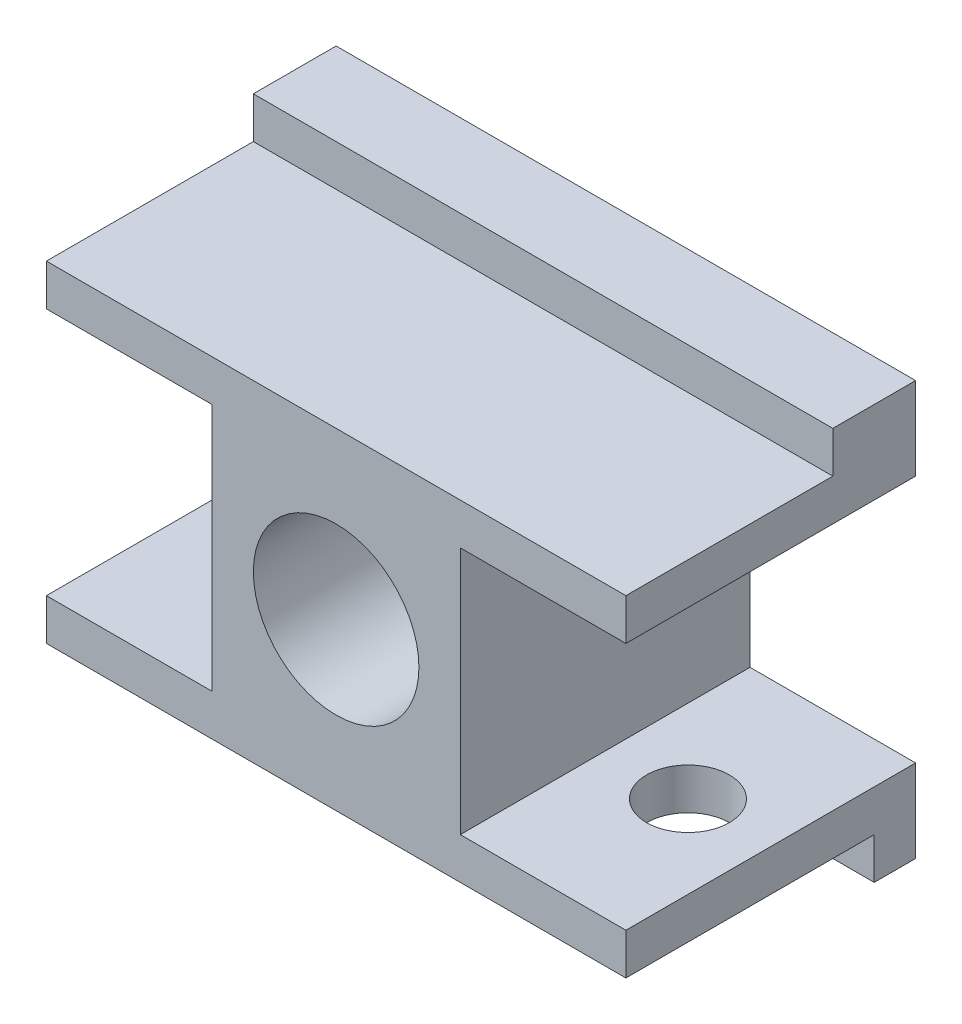
ISO-10303-21;
HEADER;
FILE_DESCRIPTION(('STEP AP214'),'2;1');
FILE_NAME('part.step','',(''),(''),'','','');
FILE_SCHEMA(('AUTOMOTIVE_DESIGN { 1 0 10303 214 1 1 1 1 }'));
ENDSEC;
DATA;
#1=APPLICATION_CONTEXT('core data for automotive mechanical design processes');
#2=APPLICATION_PROTOCOL_DEFINITION('international standard','automotive_design',2000,#1);
#3=PRODUCT_CONTEXT('',#1,'mechanical');
#4=PRODUCT('Part','Part','',(#3));
#5=PRODUCT_RELATED_PRODUCT_CATEGORY('part','',(#4));
#6=PRODUCT_DEFINITION_FORMATION('','',#4);
#7=PRODUCT_DEFINITION_CONTEXT('part definition',#1,'design');
#8=PRODUCT_DEFINITION('design','',#6,#7);
#9=PRODUCT_DEFINITION_SHAPE('','',#8);
#10=(LENGTH_UNIT() NAMED_UNIT(*) SI_UNIT(.MILLI.,.METRE.));
#11=(NAMED_UNIT(*) PLANE_ANGLE_UNIT() SI_UNIT($,.RADIAN.));
#12=(NAMED_UNIT(*) SI_UNIT($,.STERADIAN.) SOLID_ANGLE_UNIT());
#13=UNCERTAINTY_MEASURE_WITH_UNIT(LENGTH_MEASURE(1.E-05),#10,'distance_accuracy_value','');
#14=(GEOMETRIC_REPRESENTATION_CONTEXT(3) GLOBAL_UNCERTAINTY_ASSIGNED_CONTEXT((#13)) GLOBAL_UNIT_ASSIGNED_CONTEXT((#10,
#11,#12)) REPRESENTATION_CONTEXT('',''));
#15=CARTESIAN_POINT('',(0.,0.,0.));
#16=DIRECTION('',(0.,0.,1.));
#17=DIRECTION('',(1.,0.,0.));
#18=AXIS2_PLACEMENT_3D('',#15,#16,#17);
#19=CARTESIAN_POINT('',(0.,10.,0.));
#20=DIRECTION('',(0.,-1.,0.));
#21=DIRECTION('',(0.,0.,-1.));
#22=AXIS2_PLACEMENT_3D('',#19,#20,#21);
#23=PLANE('',#22);
#24=CARTESIAN_POINT('',(10.,10.,12.5));
#25=DIRECTION('',(0.,1.,0.));
#26=DIRECTION('',(0.,0.,1.));
#27=AXIS2_PLACEMENT_3D('',#24,#25,#26);
#28=CIRCLE('',#27,5.);
#29=CARTESIAN_POINT('',(10.,10.,17.5));
#30=VERTEX_POINT('',#29);
#31=EDGE_CURVE('E233',#30,#30,#28,.T.);
#32=ORIENTED_EDGE('',*,*,#31,.F.);
#33=EDGE_LOOP('',(#32));
#34=FACE_BOUND('',#33,.T.);
#35=DIRECTION('',(0.,0.,1.));
#36=VECTOR('',#35,1.);
#37=CARTESIAN_POINT('',(20.,10.,0.));
#38=LINE('',#37,#36);
#39=CARTESIAN_POINT('',(20.,10.,-5.));
#40=VERTEX_POINT('',#39);
#41=CARTESIAN_POINT('',(20.,10.,30.));
#42=VERTEX_POINT('',#41);
#43=EDGE_CURVE('E59',#40,#42,#38,.T.);
#44=ORIENTED_EDGE('',*,*,#43,.F.);
#45=DIRECTION('',(-1.,0.,0.));
#46=VECTOR('',#45,1.);
#47=CARTESIAN_POINT('',(0.,10.,-5.));
#48=LINE('',#47,#46);
#49=CARTESIAN_POINT('',(0.,10.,-5.));
#50=VERTEX_POINT('',#49);
#51=EDGE_CURVE('E263',#40,#50,#48,.T.);
#52=ORIENTED_EDGE('',*,*,#51,.T.);
#53=DIRECTION('',(0.,0.,1.));
#54=VECTOR('',#53,1.);
#55=CARTESIAN_POINT('',(0.,10.,0.));
#56=LINE('',#55,#54);
#57=CARTESIAN_POINT('',(0.,10.,30.));
#58=VERTEX_POINT('',#57);
#59=EDGE_CURVE('E267',#50,#58,#56,.T.);
#60=ORIENTED_EDGE('',*,*,#59,.T.);
#61=DIRECTION('',(-1.,0.,0.));
#62=VECTOR('',#61,1.);
#63=CARTESIAN_POINT('',(70.,10.,30.));
#64=LINE('',#63,#62);
#65=EDGE_CURVE('E244',#42,#58,#64,.T.);
#66=ORIENTED_EDGE('',*,*,#65,.F.);
#67=EDGE_LOOP('',(#44,#52,#60,#66));
#68=FACE_BOUND('',#67,.T.);
#69=ADVANCED_FACE('F34',(#34,#68),#23,.F.);
#70=CARTESIAN_POINT('',(60.,10.,12.5));
#71=DIRECTION('',(0.,1.,0.));
#72=DIRECTION('',(0.,0.,1.));
#73=AXIS2_PLACEMENT_3D('',#70,#71,#72);
#74=CIRCLE('',#73,5.);
#75=CARTESIAN_POINT('',(60.,10.,17.5));
#76=VERTEX_POINT('',#75);
#77=EDGE_CURVE('E236',#76,#76,#74,.T.);
#78=ORIENTED_EDGE('',*,*,#77,.F.);
#79=EDGE_LOOP('',(#78));
#80=FACE_BOUND('',#79,.T.);
#81=DIRECTION('',(0.,0.,-1.));
#82=VECTOR('',#81,1.);
#83=CARTESIAN_POINT('',(50.,10.,0.));
#84=LINE('',#83,#82);
#85=CARTESIAN_POINT('',(50.,10.,30.));
#86=VERTEX_POINT('',#85);
#87=CARTESIAN_POINT('',(50.,10.,-5.));
#88=VERTEX_POINT('',#87);
#89=EDGE_CURVE('E158',#86,#88,#84,.T.);
#90=ORIENTED_EDGE('',*,*,#89,.F.);
#91=CARTESIAN_POINT('',(70.,10.,30.));
#92=VERTEX_POINT('',#91);
#93=EDGE_CURVE('E240',#92,#86,#64,.T.);
#94=ORIENTED_EDGE('',*,*,#93,.F.);
#95=DIRECTION('',(0.,0.,-1.));
#96=VECTOR('',#95,1.);
#97=CARTESIAN_POINT('',(70.,10.,-5.));
#98=LINE('',#97,#96);
#99=CARTESIAN_POINT('',(70.,10.,-5.));
#100=VERTEX_POINT('',#99);
#101=EDGE_CURVE('E261',#92,#100,#98,.T.);
#102=ORIENTED_EDGE('',*,*,#101,.T.);
#103=EDGE_CURVE('E265',#100,#88,#48,.T.);
#104=ORIENTED_EDGE('',*,*,#103,.T.);
#105=EDGE_LOOP('',(#90,#94,#102,#104));
#106=FACE_BOUND('',#105,.T.);
#107=ADVANCED_FACE('F310',(#80,#106),#23,.F.);
#108=CARTESIAN_POINT('',(70.,10.,0.));
#109=DIRECTION('',(0.,0.,-1.));
#110=DIRECTION('',(-1.,0.,0.));
#111=AXIS2_PLACEMENT_3D('',#108,#109,#110);
#112=PLANE('',#111);
#113=DIRECTION('',(1.,0.,0.));
#114=VECTOR('',#113,1.);
#115=CARTESIAN_POINT('',(0.,5.,0.));
#116=LINE('',#115,#114);
#117=CARTESIAN_POINT('',(0.,5.,0.));
#118=VERTEX_POINT('',#117);
#119=CARTESIAN_POINT('',(70.,5.,0.));
#120=VERTEX_POINT('',#119);
#121=EDGE_CURVE('E252',#118,#120,#116,.T.);
#122=ORIENTED_EDGE('',*,*,#121,.F.);
#123=DIRECTION('',(0.,-1.,0.));
#124=VECTOR('',#123,1.);
#125=CARTESIAN_POINT('',(0.,10.,0.));
#126=LINE('',#125,#124);
#127=CARTESIAN_POINT('',(0.,0.,0.));
#128=VERTEX_POINT('',#127);
#129=EDGE_CURVE('E270',#118,#128,#126,.T.);
#130=ORIENTED_EDGE('',*,*,#129,.T.);
#131=DIRECTION('',(1.,0.,0.));
#132=VECTOR('',#131,1.);
#133=CARTESIAN_POINT('',(70.,0.,0.));
#134=LINE('',#133,#132);
#135=CARTESIAN_POINT('',(70.,0.,0.));
#136=VERTEX_POINT('',#135);
#137=EDGE_CURVE('E260',#128,#136,#134,.T.);
#138=ORIENTED_EDGE('',*,*,#137,.T.);
#139=DIRECTION('',(0.,-1.,0.));
#140=VECTOR('',#139,1.);
#141=CARTESIAN_POINT('',(70.,10.,0.));
#142=LINE('',#141,#140);
#143=EDGE_CURVE('E11',#120,#136,#142,.T.);
#144=ORIENTED_EDGE('',*,*,#143,.F.);
#145=EDGE_LOOP('',(#122,#130,#138,#144));
#146=FACE_BOUND('',#145,.T.);
#147=ADVANCED_FACE('F36',(#146),#112,.F.);
#148=CARTESIAN_POINT('',(70.,10.,-5.));
#149=DIRECTION('',(-1.,0.,0.));
#150=DIRECTION('',(0.,0.,1.));
#151=AXIS2_PLACEMENT_3D('',#148,#149,#150);
#152=PLANE('',#151);
#153=DIRECTION('',(0.,0.,-1.));
#154=VECTOR('',#153,1.);
#155=CARTESIAN_POINT('',(70.,0.,-5.));
#156=LINE('',#155,#154);
#157=CARTESIAN_POINT('',(70.,0.,-5.));
#158=VERTEX_POINT('',#157);
#159=EDGE_CURVE('E273',#136,#158,#156,.T.);
#160=ORIENTED_EDGE('',*,*,#159,.T.);
#161=DIRECTION('',(0.,-1.,0.));
#162=VECTOR('',#161,1.);
#163=CARTESIAN_POINT('',(70.,10.,-5.));
#164=LINE('',#163,#162);
#165=EDGE_CURVE('E43',#100,#158,#164,.T.);
#166=ORIENTED_EDGE('',*,*,#165,.F.);
#167=ORIENTED_EDGE('',*,*,#101,.F.);
#168=DIRECTION('',(0.,1.,0.));
#169=VECTOR('',#168,1.);
#170=CARTESIAN_POINT('',(70.,5.,30.));
#171=LINE('',#170,#169);
#172=CARTESIAN_POINT('',(70.,5.,30.));
#173=VERTEX_POINT('',#172);
#174=EDGE_CURVE('E248',#173,#92,#171,.T.);
#175=ORIENTED_EDGE('',*,*,#174,.F.);
#176=DIRECTION('',(0.,0.,-1.));
#177=VECTOR('',#176,1.);
#178=CARTESIAN_POINT('',(70.,5.,30.));
#179=LINE('',#178,#177);
#180=EDGE_CURVE('E251',#173,#120,#179,.T.);
#181=ORIENTED_EDGE('',*,*,#180,.T.);
#182=ORIENTED_EDGE('',*,*,#143,.T.);
#183=EDGE_LOOP('',(#160,#166,#167,#175,#181,#182));
#184=FACE_BOUND('',#183,.T.);
#185=ADVANCED_FACE('F303',(#184),#152,.F.);
#186=CARTESIAN_POINT('',(0.,10.,-5.));
#187=DIRECTION('',(0.,0.,1.));
#188=DIRECTION('',(1.,0.,0.));
#189=AXIS2_PLACEMENT_3D('',#186,#187,#188);
#190=PLANE('',#189);
#191=DIRECTION('',(-1.,0.,0.));
#192=VECTOR('',#191,1.);
#193=CARTESIAN_POINT('',(0.,0.,-5.));
#194=LINE('',#193,#192);
#195=CARTESIAN_POINT('',(0.,0.,-5.));
#196=VERTEX_POINT('',#195);
#197=EDGE_CURVE('E275',#158,#196,#194,.T.);
#198=ORIENTED_EDGE('',*,*,#197,.T.);
#199=DIRECTION('',(0.,-1.,0.));
#200=VECTOR('',#199,1.);
#201=CARTESIAN_POINT('',(0.,10.,-5.));
#202=LINE('',#201,#200);
#203=EDGE_CURVE('E280',#50,#196,#202,.T.);
#204=ORIENTED_EDGE('',*,*,#203,.F.);
#205=ORIENTED_EDGE('',*,*,#51,.F.);
#206=DIRECTION('',(0.,-1.,0.));
#207=VECTOR('',#206,1.);
#208=CARTESIAN_POINT('',(20.,40.,-5.));
#209=LINE('',#208,#207);
#210=CARTESIAN_POINT('',(20.,40.,-5.));
#211=VERTEX_POINT('',#210);
#212=EDGE_CURVE('E224',#211,#40,#209,.T.);
#213=ORIENTED_EDGE('',*,*,#212,.F.);
#214=DIRECTION('',(-1.,0.,0.));
#215=VECTOR('',#214,1.);
#216=CARTESIAN_POINT('',(20.,40.,-5.));
#217=LINE('',#216,#215);
#218=CARTESIAN_POINT('',(0.,40.,-5.));
#219=VERTEX_POINT('',#218);
#220=EDGE_CURVE('E155',#211,#219,#217,.T.);
#221=ORIENTED_EDGE('',*,*,#220,.T.);
#222=DIRECTION('',(0.,-1.,0.));
#223=VECTOR('',#222,1.);
#224=CARTESIAN_POINT('',(0.,45.,-5.));
#225=LINE('',#224,#223);
#226=CARTESIAN_POINT('',(0.,50.,-5.));
#227=VERTEX_POINT('',#226);
#228=EDGE_CURVE('E148',#227,#219,#225,.T.);
#229=ORIENTED_EDGE('',*,*,#228,.F.);
#230=DIRECTION('',(-1.,0.,0.));
#231=VECTOR('',#230,1.);
#232=CARTESIAN_POINT('',(70.,50.,-5.));
#233=LINE('',#232,#231);
#234=CARTESIAN_POINT('',(70.,50.,-5.));
#235=VERTEX_POINT('',#234);
#236=EDGE_CURVE('E153',#235,#227,#233,.T.);
#237=ORIENTED_EDGE('',*,*,#236,.F.);
#238=DIRECTION('',(0.,-1.,0.));
#239=VECTOR('',#238,1.);
#240=CARTESIAN_POINT('',(70.,45.,-5.));
#241=LINE('',#240,#239);
#242=CARTESIAN_POINT('',(70.,40.,-5.));
#243=VERTEX_POINT('',#242);
#244=EDGE_CURVE('E194',#235,#243,#241,.T.);
#245=ORIENTED_EDGE('',*,*,#244,.T.);
#246=CARTESIAN_POINT('',(50.,40.,-5.));
#247=VERTEX_POINT('',#246);
#248=EDGE_CURVE('E195',#243,#247,#217,.T.);
#249=ORIENTED_EDGE('',*,*,#248,.T.);
#250=DIRECTION('',(0.,-1.,0.));
#251=VECTOR('',#250,1.);
#252=CARTESIAN_POINT('',(50.,40.,-5.));
#253=LINE('',#252,#251);
#254=EDGE_CURVE('E227',#247,#88,#253,.T.);
#255=ORIENTED_EDGE('',*,*,#254,.T.);
#256=ORIENTED_EDGE('',*,*,#103,.F.);
#257=ORIENTED_EDGE('',*,*,#165,.T.);
#258=EDGE_LOOP('',(#198,#204,#205,#213,#221,#229,#237,#245,#249,#255,#256,#257));
#259=FACE_BOUND('',#258,.T.);
#260=ADVANCED_FACE('F150',(#259),#190,.F.);
#261=CARTESIAN_POINT('',(0.,10.,0.));
#262=DIRECTION('',(1.,0.,0.));
#263=DIRECTION('',(0.,0.,-1.));
#264=AXIS2_PLACEMENT_3D('',#261,#262,#263);
#265=PLANE('',#264);
#266=DIRECTION('',(0.,0.,1.));
#267=VECTOR('',#266,1.);
#268=CARTESIAN_POINT('',(0.,0.,0.));
#269=LINE('',#268,#267);
#270=EDGE_CURVE('E264',#196,#128,#269,.T.);
#271=ORIENTED_EDGE('',*,*,#270,.T.);
#272=ORIENTED_EDGE('',*,*,#129,.F.);
#273=DIRECTION('',(0.,0.,-1.));
#274=VECTOR('',#273,1.);
#275=CARTESIAN_POINT('',(0.,5.,30.));
#276=LINE('',#275,#274);
#277=CARTESIAN_POINT('',(0.,5.,30.));
#278=VERTEX_POINT('',#277);
#279=EDGE_CURVE('E257',#278,#118,#276,.T.);
#280=ORIENTED_EDGE('',*,*,#279,.F.);
#281=DIRECTION('',(0.,-1.,0.));
#282=VECTOR('',#281,1.);
#283=CARTESIAN_POINT('',(0.,10.,30.));
#284=LINE('',#283,#282);
#285=EDGE_CURVE('E243',#58,#278,#284,.T.);
#286=ORIENTED_EDGE('',*,*,#285,.F.);
#287=ORIENTED_EDGE('',*,*,#59,.F.);
#288=ORIENTED_EDGE('',*,*,#203,.T.);
#289=EDGE_LOOP('',(#271,#272,#280,#286,#287,#288));
#290=FACE_BOUND('',#289,.T.);
#291=ADVANCED_FACE('F335',(#290),#265,.F.);
#292=CARTESIAN_POINT('',(0.,0.,0.));
#293=DIRECTION('',(0.,-1.,0.));
#294=DIRECTION('',(0.,0.,-1.));
#295=AXIS2_PLACEMENT_3D('',#292,#293,#294);
#296=PLANE('',#295);
#297=ORIENTED_EDGE('',*,*,#137,.F.);
#298=ORIENTED_EDGE('',*,*,#270,.F.);
#299=ORIENTED_EDGE('',*,*,#197,.F.);
#300=ORIENTED_EDGE('',*,*,#159,.F.);
#301=EDGE_LOOP('',(#297,#298,#299,#300));
#302=FACE_BOUND('',#301,.T.);
#303=ADVANCED_FACE('F293',(#302),#296,.T.);
#304=CARTESIAN_POINT('',(0.,5.,30.));
#305=DIRECTION('',(0.,1.,0.));
#306=DIRECTION('',(0.,0.,1.));
#307=AXIS2_PLACEMENT_3D('',#304,#305,#306);
#308=PLANE('',#307);
#309=CARTESIAN_POINT('',(10.,5.,12.5));
#310=DIRECTION('',(0.,1.,0.));
#311=DIRECTION('',(0.,0.,1.));
#312=AXIS2_PLACEMENT_3D('',#309,#310,#311);
#313=CIRCLE('',#312,5.);
#314=CARTESIAN_POINT('',(10.,5.,17.5));
#315=VERTEX_POINT('',#314);
#316=EDGE_CURVE('E38',#315,#315,#313,.F.);
#317=ORIENTED_EDGE('',*,*,#316,.F.);
#318=EDGE_LOOP('',(#317));
#319=FACE_BOUND('',#318,.T.);
#320=CARTESIAN_POINT('',(60.,5.,12.5));
#321=DIRECTION('',(0.,1.,0.));
#322=DIRECTION('',(0.,0.,1.));
#323=AXIS2_PLACEMENT_3D('',#320,#321,#322);
#324=CIRCLE('',#323,5.);
#325=CARTESIAN_POINT('',(60.,5.,17.5));
#326=VERTEX_POINT('',#325);
#327=EDGE_CURVE('E239',#326,#326,#324,.F.);
#328=ORIENTED_EDGE('',*,*,#327,.F.);
#329=EDGE_LOOP('',(#328));
#330=FACE_BOUND('',#329,.T.);
#331=ORIENTED_EDGE('',*,*,#121,.T.);
#332=ORIENTED_EDGE('',*,*,#180,.F.);
#333=DIRECTION('',(1.,0.,0.));
#334=VECTOR('',#333,1.);
#335=CARTESIAN_POINT('',(0.,5.,30.));
#336=LINE('',#335,#334);
#337=EDGE_CURVE('E246',#278,#173,#336,.T.);
#338=ORIENTED_EDGE('',*,*,#337,.F.);
#339=ORIENTED_EDGE('',*,*,#279,.T.);
#340=EDGE_LOOP('',(#331,#332,#338,#339));
#341=FACE_BOUND('',#340,.T.);
#342=ADVANCED_FACE('F289',(#319,#330,#341),#308,.F.);
#343=CARTESIAN_POINT('',(0.,0.,30.));
#344=DIRECTION('',(0.,0.,1.));
#345=DIRECTION('',(1.,0.,0.));
#346=AXIS2_PLACEMENT_3D('',#343,#344,#345);
#347=PLANE('',#346);
#348=CARTESIAN_POINT('',(35.,25.,30.));
#349=DIRECTION('',(0.,0.,1.));
#350=DIRECTION('',(1.,0.,0.));
#351=AXIS2_PLACEMENT_3D('',#348,#349,#350);
#352=CIRCLE('',#351,10.);
#353=CARTESIAN_POINT('',(45.,25.,30.));
#354=VERTEX_POINT('',#353);
#355=EDGE_CURVE('E178',#354,#354,#352,.T.);
#356=ORIENTED_EDGE('',*,*,#355,.F.);
#357=EDGE_LOOP('',(#356));
#358=FACE_BOUND('',#357,.T.);
#359=ORIENTED_EDGE('',*,*,#93,.T.);
#360=DIRECTION('',(0.,-1.,0.));
#361=VECTOR('',#360,1.);
#362=CARTESIAN_POINT('',(50.,40.,30.));
#363=LINE('',#362,#361);
#364=CARTESIAN_POINT('',(50.,40.,30.));
#365=VERTEX_POINT('',#364);
#366=EDGE_CURVE('E230',#365,#86,#363,.T.);
#367=ORIENTED_EDGE('',*,*,#366,.F.);
#368=DIRECTION('',(1.,0.,0.));
#369=VECTOR('',#368,1.);
#370=CARTESIAN_POINT('',(0.,40.,30.));
#371=LINE('',#370,#369);
#372=CARTESIAN_POINT('',(70.,40.,30.));
#373=VERTEX_POINT('',#372);
#374=EDGE_CURVE('E200',#365,#373,#371,.T.);
#375=ORIENTED_EDGE('',*,*,#374,.T.);
#376=DIRECTION('',(0.,-1.,0.));
#377=VECTOR('',#376,1.);
#378=CARTESIAN_POINT('',(70.,45.,30.));
#379=LINE('',#378,#377);
#380=CARTESIAN_POINT('',(70.,45.,30.));
#381=VERTEX_POINT('',#380);
#382=EDGE_CURVE('E207',#381,#373,#379,.T.);
#383=ORIENTED_EDGE('',*,*,#382,.F.);
#384=DIRECTION('',(1.,0.,0.));
#385=VECTOR('',#384,1.);
#386=CARTESIAN_POINT('',(0.,45.,30.));
#387=LINE('',#386,#385);
#388=CARTESIAN_POINT('',(0.,45.,30.));
#389=VERTEX_POINT('',#388);
#390=EDGE_CURVE('E189',#389,#381,#387,.T.);
#391=ORIENTED_EDGE('',*,*,#390,.F.);
#392=DIRECTION('',(0.,-1.,0.));
#393=VECTOR('',#392,1.);
#394=CARTESIAN_POINT('',(0.,45.,30.));
#395=LINE('',#394,#393);
#396=CARTESIAN_POINT('',(0.,40.,30.));
#397=VERTEX_POINT('',#396);
#398=EDGE_CURVE('E159',#389,#397,#395,.T.);
#399=ORIENTED_EDGE('',*,*,#398,.T.);
#400=CARTESIAN_POINT('',(20.,40.,30.));
#401=VERTEX_POINT('',#400);
#402=EDGE_CURVE('E201',#397,#401,#371,.T.);
#403=ORIENTED_EDGE('',*,*,#402,.T.);
#404=DIRECTION('',(0.,-1.,0.));
#405=VECTOR('',#404,1.);
#406=CARTESIAN_POINT('',(20.,40.,30.));
#407=LINE('',#406,#405);
#408=EDGE_CURVE('E218',#401,#42,#407,.T.);
#409=ORIENTED_EDGE('',*,*,#408,.T.);
#410=ORIENTED_EDGE('',*,*,#65,.T.);
#411=ORIENTED_EDGE('',*,*,#285,.T.);
#412=ORIENTED_EDGE('',*,*,#337,.T.);
#413=ORIENTED_EDGE('',*,*,#174,.T.);
#414=EDGE_LOOP('',(#359,#367,#375,#383,#391,#399,#403,#409,#410,#411,#412,#413));
#415=FACE_BOUND('',#414,.T.);
#416=ADVANCED_FACE('F292',(#358,#415),#347,.T.);
#417=CARTESIAN_POINT('',(60.,10.,12.5));
#418=DIRECTION('',(0.,-1.,0.));
#419=DIRECTION('',(0.,0.,-1.));
#420=AXIS2_PLACEMENT_3D('',#417,#418,#419);
#421=CYLINDRICAL_SURFACE('',#420,5.);
#422=ORIENTED_EDGE('',*,*,#77,.T.);
#423=EDGE_LOOP('',(#422));
#424=FACE_BOUND('',#423,.T.);
#425=ORIENTED_EDGE('',*,*,#327,.T.);
#426=EDGE_LOOP('',(#425));
#427=FACE_BOUND('',#426,.T.);
#428=ADVANCED_FACE('F287',(#424,#427),#421,.F.);
#429=CARTESIAN_POINT('',(10.,10.,12.5));
#430=DIRECTION('',(0.,-1.,0.));
#431=DIRECTION('',(0.,0.,-1.));
#432=AXIS2_PLACEMENT_3D('',#429,#430,#431);
#433=CYLINDRICAL_SURFACE('',#432,5.);
#434=ORIENTED_EDGE('',*,*,#31,.T.);
#435=EDGE_LOOP('',(#434));
#436=FACE_BOUND('',#435,.T.);
#437=ORIENTED_EDGE('',*,*,#316,.T.);
#438=EDGE_LOOP('',(#437));
#439=FACE_BOUND('',#438,.T.);
#440=ADVANCED_FACE('F360',(#436,#439),#433,.F.);
#441=CARTESIAN_POINT('',(50.,40.,0.));
#442=DIRECTION('',(-1.,0.,0.));
#443=DIRECTION('',(0.,0.,1.));
#444=AXIS2_PLACEMENT_3D('',#441,#442,#443);
#445=PLANE('',#444);
#446=ORIENTED_EDGE('',*,*,#89,.T.);
#447=ORIENTED_EDGE('',*,*,#254,.F.);
#448=DIRECTION('',(0.,0.,-1.));
#449=VECTOR('',#448,1.);
#450=CARTESIAN_POINT('',(50.,40.,0.));
#451=LINE('',#450,#449);
#452=EDGE_CURVE('E212',#365,#247,#451,.T.);
#453=ORIENTED_EDGE('',*,*,#452,.F.);
#454=ORIENTED_EDGE('',*,*,#366,.T.);
#455=EDGE_LOOP('',(#446,#447,#453,#454));
#456=FACE_BOUND('',#455,.T.);
#457=ADVANCED_FACE('F313',(#456),#445,.F.);
#458=CARTESIAN_POINT('',(20.,40.,0.));
#459=DIRECTION('',(1.,0.,0.));
#460=DIRECTION('',(0.,0.,-1.));
#461=AXIS2_PLACEMENT_3D('',#458,#459,#460);
#462=PLANE('',#461);
#463=ORIENTED_EDGE('',*,*,#43,.T.);
#464=ORIENTED_EDGE('',*,*,#408,.F.);
#465=DIRECTION('',(0.,0.,1.));
#466=VECTOR('',#465,1.);
#467=CARTESIAN_POINT('',(20.,40.,0.));
#468=LINE('',#467,#466);
#469=EDGE_CURVE('E215',#211,#401,#468,.T.);
#470=ORIENTED_EDGE('',*,*,#469,.F.);
#471=ORIENTED_EDGE('',*,*,#212,.T.);
#472=EDGE_LOOP('',(#463,#464,#470,#471));
#473=FACE_BOUND('',#472,.T.);
#474=ADVANCED_FACE('F330',(#473),#462,.F.);
#475=CARTESIAN_POINT('',(0.,40.,0.));
#476=DIRECTION('',(0.,1.,0.));
#477=DIRECTION('',(0.,0.,1.));
#478=AXIS2_PLACEMENT_3D('',#475,#476,#477);
#479=PLANE('',#478);
#480=ORIENTED_EDGE('',*,*,#374,.F.);
#481=ORIENTED_EDGE('',*,*,#452,.T.);
#482=ORIENTED_EDGE('',*,*,#248,.F.);
#483=DIRECTION('',(0.,0.,-1.));
#484=VECTOR('',#483,1.);
#485=CARTESIAN_POINT('',(70.,40.,30.));
#486=LINE('',#485,#484);
#487=EDGE_CURVE('E190',#373,#243,#486,.T.);
#488=ORIENTED_EDGE('',*,*,#487,.F.);
#489=EDGE_LOOP('',(#480,#481,#482,#488));
#490=FACE_BOUND('',#489,.T.);
#491=ADVANCED_FACE('F317',(#490),#479,.F.);
#492=ORIENTED_EDGE('',*,*,#220,.F.);
#493=ORIENTED_EDGE('',*,*,#469,.T.);
#494=ORIENTED_EDGE('',*,*,#402,.F.);
#495=DIRECTION('',(0.,0.,1.));
#496=VECTOR('',#495,1.);
#497=CARTESIAN_POINT('',(0.,40.,-5.));
#498=LINE('',#497,#496);
#499=EDGE_CURVE('E198',#219,#397,#498,.T.);
#500=ORIENTED_EDGE('',*,*,#499,.F.);
#501=EDGE_LOOP('',(#492,#493,#494,#500));
#502=FACE_BOUND('',#501,.T.);
#503=ADVANCED_FACE('F327',(#502),#479,.F.);
#504=CARTESIAN_POINT('',(0.,45.,-5.));
#505=DIRECTION('',(1.,0.,0.));
#506=DIRECTION('',(0.,0.,-1.));
#507=AXIS2_PLACEMENT_3D('',#504,#505,#506);
#508=PLANE('',#507);
#509=ORIENTED_EDGE('',*,*,#499,.T.);
#510=ORIENTED_EDGE('',*,*,#398,.F.);
#511=DIRECTION('',(0.,0.,1.));
#512=VECTOR('',#511,1.);
#513=CARTESIAN_POINT('',(0.,45.,-5.));
#514=LINE('',#513,#512);
#515=CARTESIAN_POINT('',(0.,45.,5.));
#516=VERTEX_POINT('',#515);
#517=EDGE_CURVE('E187',#516,#389,#514,.T.);
#518=ORIENTED_EDGE('',*,*,#517,.F.);
#519=DIRECTION('',(0.,-1.,0.));
#520=VECTOR('',#519,1.);
#521=CARTESIAN_POINT('',(0.,50.,5.));
#522=LINE('',#521,#520);
#523=CARTESIAN_POINT('',(0.,50.,5.));
#524=VERTEX_POINT('',#523);
#525=EDGE_CURVE('E165',#524,#516,#522,.T.);
#526=ORIENTED_EDGE('',*,*,#525,.F.);
#527=DIRECTION('',(0.,0.,1.));
#528=VECTOR('',#527,1.);
#529=CARTESIAN_POINT('',(0.,50.,-5.));
#530=LINE('',#529,#528);
#531=EDGE_CURVE('E162',#227,#524,#530,.T.);
#532=ORIENTED_EDGE('',*,*,#531,.F.);
#533=ORIENTED_EDGE('',*,*,#228,.T.);
#534=EDGE_LOOP('',(#509,#510,#518,#526,#532,#533));
#535=FACE_BOUND('',#534,.T.);
#536=ADVANCED_FACE('F163',(#535),#508,.F.);
#537=CARTESIAN_POINT('',(70.,45.,30.));
#538=DIRECTION('',(-1.,0.,0.));
#539=DIRECTION('',(0.,0.,1.));
#540=AXIS2_PLACEMENT_3D('',#537,#538,#539);
#541=PLANE('',#540);
#542=ORIENTED_EDGE('',*,*,#487,.T.);
#543=ORIENTED_EDGE('',*,*,#244,.F.);
#544=DIRECTION('',(0.,0.,-1.));
#545=VECTOR('',#544,1.);
#546=CARTESIAN_POINT('',(70.,50.,-5.));
#547=LINE('',#546,#545);
#548=CARTESIAN_POINT('',(70.,50.,5.));
#549=VERTEX_POINT('',#548);
#550=EDGE_CURVE('E173',#549,#235,#547,.T.);
#551=ORIENTED_EDGE('',*,*,#550,.F.);
#552=DIRECTION('',(0.,-1.,0.));
#553=VECTOR('',#552,1.);
#554=CARTESIAN_POINT('',(70.,50.,5.));
#555=LINE('',#554,#553);
#556=CARTESIAN_POINT('',(70.,45.,5.));
#557=VERTEX_POINT('',#556);
#558=EDGE_CURVE('E182',#549,#557,#555,.T.);
#559=ORIENTED_EDGE('',*,*,#558,.T.);
#560=DIRECTION('',(0.,0.,-1.));
#561=VECTOR('',#560,1.);
#562=CARTESIAN_POINT('',(70.,45.,30.));
#563=LINE('',#562,#561);
#564=EDGE_CURVE('E192',#381,#557,#563,.T.);
#565=ORIENTED_EDGE('',*,*,#564,.F.);
#566=ORIENTED_EDGE('',*,*,#382,.T.);
#567=EDGE_LOOP('',(#542,#543,#551,#559,#565,#566));
#568=FACE_BOUND('',#567,.T.);
#569=ADVANCED_FACE('F319',(#568),#541,.F.);
#570=CARTESIAN_POINT('',(0.,45.,0.));
#571=DIRECTION('',(0.,1.,0.));
#572=DIRECTION('',(0.,0.,1.));
#573=AXIS2_PLACEMENT_3D('',#570,#571,#572);
#574=PLANE('',#573);
#575=DIRECTION('',(1.,0.,0.));
#576=VECTOR('',#575,1.);
#577=CARTESIAN_POINT('',(0.,45.,5.));
#578=LINE('',#577,#576);
#579=EDGE_CURVE('E51',#516,#557,#578,.T.);
#580=ORIENTED_EDGE('',*,*,#579,.F.);
#581=ORIENTED_EDGE('',*,*,#517,.T.);
#582=ORIENTED_EDGE('',*,*,#390,.T.);
#583=ORIENTED_EDGE('',*,*,#564,.T.);
#584=EDGE_LOOP('',(#580,#581,#582,#583));
#585=FACE_BOUND('',#584,.T.);
#586=ADVANCED_FACE('F325',(#585),#574,.T.);
#587=CARTESIAN_POINT('',(0.,50.,5.));
#588=DIRECTION('',(0.,0.,-1.));
#589=DIRECTION('',(-1.,0.,0.));
#590=AXIS2_PLACEMENT_3D('',#587,#588,#589);
#591=PLANE('',#590);
#592=ORIENTED_EDGE('',*,*,#579,.T.);
#593=ORIENTED_EDGE('',*,*,#558,.F.);
#594=DIRECTION('',(1.,0.,0.));
#595=VECTOR('',#594,1.);
#596=CARTESIAN_POINT('',(0.,50.,5.));
#597=LINE('',#596,#595);
#598=EDGE_CURVE('E168',#524,#549,#597,.T.);
#599=ORIENTED_EDGE('',*,*,#598,.F.);
#600=ORIENTED_EDGE('',*,*,#525,.T.);
#601=EDGE_LOOP('',(#592,#593,#599,#600));
#602=FACE_BOUND('',#601,.T.);
#603=ADVANCED_FACE('F377',(#602),#591,.F.);
#604=CARTESIAN_POINT('',(0.,50.,0.));
#605=DIRECTION('',(0.,1.,0.));
#606=DIRECTION('',(0.,0.,1.));
#607=AXIS2_PLACEMENT_3D('',#604,#605,#606);
#608=PLANE('',#607);
#609=ORIENTED_EDGE('',*,*,#236,.T.);
#610=ORIENTED_EDGE('',*,*,#531,.T.);
#611=ORIENTED_EDGE('',*,*,#598,.T.);
#612=ORIENTED_EDGE('',*,*,#550,.T.);
#613=EDGE_LOOP('',(#609,#610,#611,#612));
#614=FACE_BOUND('',#613,.T.);
#615=ADVANCED_FACE('F171',(#614),#608,.T.);
#616=CARTESIAN_POINT('',(35.,25.,0.));
#617=DIRECTION('',(0.,0.,1.));
#618=DIRECTION('',(1.,0.,0.));
#619=AXIS2_PLACEMENT_3D('',#616,#617,#618);
#620=CYLINDRICAL_SURFACE('',#619,10.);
#621=CARTESIAN_POINT('',(35.,25.,0.));
#622=DIRECTION('',(0.,0.,1.));
#623=DIRECTION('',(1.,0.,0.));
#624=AXIS2_PLACEMENT_3D('',#621,#622,#623);
#625=CIRCLE('',#624,10.);
#626=CARTESIAN_POINT('',(45.,25.,0.));
#627=VERTEX_POINT('',#626);
#628=EDGE_CURVE('E175',#627,#627,#625,.T.);
#629=ORIENTED_EDGE('',*,*,#628,.F.);
#630=EDGE_LOOP('',(#629));
#631=FACE_BOUND('',#630,.T.);
#632=ORIENTED_EDGE('',*,*,#355,.T.);
#633=EDGE_LOOP('',(#632));
#634=FACE_BOUND('',#633,.T.);
#635=ADVANCED_FACE('F383',(#631,#634),#620,.F.);
#636=CARTESIAN_POINT('',(35.,25.,0.));
#637=DIRECTION('',(0.,0.,1.));
#638=DIRECTION('',(1.,0.,0.));
#639=AXIS2_PLACEMENT_3D('',#636,#637,#638);
#640=PLANE('',#639);
#641=ORIENTED_EDGE('',*,*,#628,.T.);
#642=EDGE_LOOP('',(#641));
#643=FACE_BOUND('',#642,.T.);
#644=ADVANCED_FACE('F386',(#643),#640,.T.);
#645=CLOSED_SHELL('',(#69,#107,#147,#185,#260,#291,#303,#342,#416,#428,#440,#457,#474,#491,#503,
#536,#569,#586,#603,#615,#635,#644));
#646=MANIFOLD_SOLID_BREP('B2',#645);
#647=ADVANCED_BREP_SHAPE_REPRESENTATION('',(#18,#646),#14);
#648=SHAPE_DEFINITION_REPRESENTATION(#9,#647);
ENDSEC;
END-ISO-10303-21;
